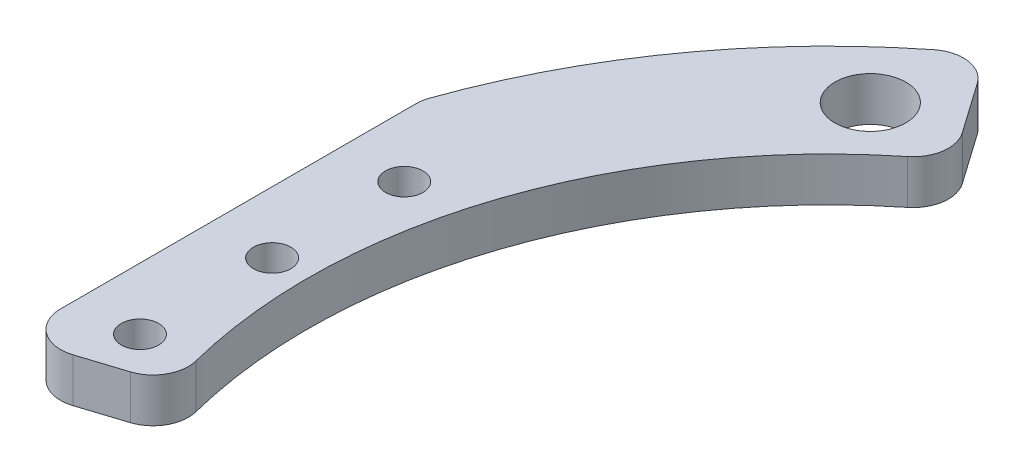
ISO-10303-21;
HEADER;
FILE_DESCRIPTION(('STEP AP214'),'2;1');
FILE_NAME('part.step','',(''),(''),'','','');
FILE_SCHEMA(('AUTOMOTIVE_DESIGN { 1 0 10303 214 1 1 1 1 }'));
ENDSEC;
DATA;
#1=APPLICATION_CONTEXT('core data for automotive mechanical design processes');
#2=APPLICATION_PROTOCOL_DEFINITION('international standard','automotive_design',2000,#1);
#3=PRODUCT_CONTEXT('',#1,'mechanical');
#4=PRODUCT('Part','Part','',(#3));
#5=PRODUCT_RELATED_PRODUCT_CATEGORY('part','',(#4));
#6=PRODUCT_DEFINITION_FORMATION('','',#4);
#7=PRODUCT_DEFINITION_CONTEXT('part definition',#1,'design');
#8=PRODUCT_DEFINITION('design','',#6,#7);
#9=PRODUCT_DEFINITION_SHAPE('','',#8);
#10=(LENGTH_UNIT() NAMED_UNIT(*) SI_UNIT(.MILLI.,.METRE.));
#11=(NAMED_UNIT(*) PLANE_ANGLE_UNIT() SI_UNIT($,.RADIAN.));
#12=(NAMED_UNIT(*) SI_UNIT($,.STERADIAN.) SOLID_ANGLE_UNIT());
#13=UNCERTAINTY_MEASURE_WITH_UNIT(LENGTH_MEASURE(1.E-05),#10,'distance_accuracy_value','');
#14=(GEOMETRIC_REPRESENTATION_CONTEXT(3) GLOBAL_UNCERTAINTY_ASSIGNED_CONTEXT((#13)) GLOBAL_UNIT_ASSIGNED_CONTEXT((#10,
#11,#12)) REPRESENTATION_CONTEXT('',''));
#15=CARTESIAN_POINT('',(0.,0.,0.));
#16=DIRECTION('',(0.,0.,1.));
#17=DIRECTION('',(1.,0.,0.));
#18=AXIS2_PLACEMENT_3D('',#15,#16,#17);
#19=CARTESIAN_POINT('',(0.,2.5,0.));
#20=DIRECTION('',(0.,1.,0.));
#21=DIRECTION('',(0.,0.,1.));
#22=AXIS2_PLACEMENT_3D('',#19,#20,#21);
#23=PLANE('',#22);
#24=CARTESIAN_POINT('',(0.,2.5,0.));
#25=DIRECTION('',(0.,1.,0.));
#26=DIRECTION('',(0.,0.,1.));
#27=AXIS2_PLACEMENT_3D('',#24,#25,#26);
#28=CIRCLE('',#27,74.);
#29=CARTESIAN_POINT('',(-45.9043498009371,2.5,-58.0412841807726));
#30=VERTEX_POINT('',#29);
#31=CARTESIAN_POINT('',(-69.7714285714286,2.5,-24.6565965839172));
#32=VERTEX_POINT('',#31);
#33=EDGE_CURVE('E127',#30,#32,#28,.T.);
#34=ORIENTED_EDGE('',*,*,#33,.T.);
#35=CARTESIAN_POINT('',(-66.,2.5,-23.3238075793811));
#36=DIRECTION('',(0.,1.,0.));
#37=DIRECTION('',(0.,0.,1.));
#38=AXIS2_PLACEMENT_3D('',#35,#36,#37);
#39=CIRCLE('',#38,4.);
#40=CARTESIAN_POINT('',(-70.,2.5,-23.3238075793811));
#41=VERTEX_POINT('',#40);
#42=EDGE_CURVE('E160',#32,#41,#39,.T.);
#43=ORIENTED_EDGE('',*,*,#42,.T.);
#44=DIRECTION('',(0.,0.,-1.));
#45=VECTOR('',#44,1.);
#46=CARTESIAN_POINT('',(-70.,2.5,0.));
#47=LINE('',#46,#45);
#48=CARTESIAN_POINT('',(-70.,2.5,17.0147788840506));
#49=VERTEX_POINT('',#48);
#50=EDGE_CURVE('E212',#49,#41,#47,.T.);
#51=ORIENTED_EDGE('',*,*,#50,.F.);
#52=CARTESIAN_POINT('',(-66.,2.5,17.0147788840506));
#53=DIRECTION('',(0.,1.,0.));
#54=DIRECTION('',(0.,0.,1.));
#55=AXIS2_PLACEMENT_3D('',#52,#53,#54);
#56=CIRCLE('',#55,4.);
#57=CARTESIAN_POINT('',(-64.7758541655303,2.5,20.82285805549));
#58=VERTEX_POINT('',#57);
#59=EDGE_CURVE('E158',#49,#58,#56,.T.);
#60=ORIENTED_EDGE('',*,*,#59,.T.);
#61=DIRECTION('',(0.952019792859847,0.,-0.306036458617425));
#62=VECTOR('',#61,1.);
#63=CARTESIAN_POINT('',(-70.4494646716287,2.5,22.6466979376894));
#64=LINE('',#63,#62);
#65=CARTESIAN_POINT('',(-59.8562334660791,2.5,19.2413958759294));
#66=VERTEX_POINT('',#65);
#67=EDGE_CURVE('E188',#58,#66,#64,.T.);
#68=ORIENTED_EDGE('',*,*,#67,.T.);
#69=CARTESIAN_POINT('',(-61.0803793005488,2.5,15.43331670449));
#70=DIRECTION('',(0.,1.,0.));
#71=DIRECTION('',(0.,0.,1.));
#72=AXIS2_PLACEMENT_3D('',#69,#70,#71);
#73=CIRCLE('',#72,4.);
#74=CARTESIAN_POINT('',(-57.202259979879,2.5,14.4534235803954));
#75=VERTEX_POINT('',#74);
#76=EDGE_CURVE('E156',#66,#75,#73,.T.);
#77=ORIENTED_EDGE('',*,*,#76,.T.);
#78=CARTESIAN_POINT('',(0.,2.5,0.));
#79=DIRECTION('',(0.,-1.,0.));
#80=DIRECTION('',(0.,0.,1.));
#81=AXIS2_PLACEMENT_3D('',#78,#79,#80);
#82=CIRCLE('',#81,59.);
#83=CARTESIAN_POINT('',(-36.8930249751412,2.5,-46.0424229182566));
#84=VERTEX_POINT('',#83);
#85=EDGE_CURVE('E187',#75,#84,#82,.T.);
#86=ORIENTED_EDGE('',*,*,#85,.T.);
#87=CARTESIAN_POINT('',(-39.3942470073542,2.5,-49.1639431161046));
#88=DIRECTION('',(0.,1.,0.));
#89=DIRECTION('',(0.,0.,1.));
#90=AXIS2_PLACEMENT_3D('',#87,#88,#89);
#91=CIRCLE('',#90,4.);
#92=CARTESIAN_POINT('',(-36.1202172170468,2.5,-51.4619267827523));
#93=VERTEX_POINT('',#92);
#94=EDGE_CURVE('E154',#84,#93,#91,.T.);
#95=ORIENTED_EDGE('',*,*,#94,.T.);
#96=DIRECTION('',(-0.574495916661929,0.,-0.81850744757685));
#97=VECTOR('',#96,1.);
#98=CARTESIAN_POINT('',(-42.5126978329828,2.5,-60.5695511206869));
#99=LINE('',#98,#97);
#100=CARTESIAN_POINT('',(-40.1490038051736,2.5,-57.2019011349461));
#101=VERTEX_POINT('',#100);
#102=EDGE_CURVE('E129',#93,#101,#99,.T.);
#103=ORIENTED_EDGE('',*,*,#102,.T.);
#104=CARTESIAN_POINT('',(-43.4230335954811,2.5,-54.9039174682984));
#105=DIRECTION('',(0.,1.,0.));
#106=DIRECTION('',(0.,0.,1.));
#107=AXIS2_PLACEMENT_3D('',#104,#105,#106);
#108=CIRCLE('',#107,4.);
#109=EDGE_CURVE('E152',#101,#30,#108,.T.);
#110=ORIENTED_EDGE('',*,*,#109,.T.);
#111=EDGE_LOOP('',(#34,#43,#51,#60,#68,#77,#86,#95,#103,#110));
#112=FACE_BOUND('',#111,.T.);
#113=CARTESIAN_POINT('',(-44.3299026712743,2.5,-49.2333446878774));
#114=DIRECTION('',(0.,1.,0.));
#115=DIRECTION('',(0.,0.,1.));
#116=AXIS2_PLACEMENT_3D('',#113,#114,#115);
#117=CIRCLE('',#116,4.025);
#118=CARTESIAN_POINT('',(-44.3299026712743,2.5,-45.2083446878774));
#119=VERTEX_POINT('',#118);
#120=EDGE_CURVE('E200',#119,#119,#117,.T.);
#121=ORIENTED_EDGE('',*,*,#120,.F.);
#122=EDGE_LOOP('',(#121));
#123=FACE_BOUND('',#122,.T.);
#124=CARTESIAN_POINT('',(-63.,2.5,0.));
#125=DIRECTION('',(0.,1.,0.));
#126=DIRECTION('',(0.,0.,1.));
#127=AXIS2_PLACEMENT_3D('',#124,#125,#126);
#128=CIRCLE('',#127,2.125);
#129=CARTESIAN_POINT('',(-63.,2.5,2.12500000000001));
#130=VERTEX_POINT('',#129);
#131=EDGE_CURVE('E137',#130,#130,#128,.T.);
#132=ORIENTED_EDGE('',*,*,#131,.F.);
#133=EDGE_LOOP('',(#132));
#134=FACE_BOUND('',#133,.T.);
#135=CARTESIAN_POINT('',(-63.,2.5,15.));
#136=DIRECTION('',(0.,1.,0.));
#137=DIRECTION('',(0.,0.,1.));
#138=AXIS2_PLACEMENT_3D('',#135,#136,#137);
#139=CIRCLE('',#138,2.125);
#140=CARTESIAN_POINT('',(-63.,2.5,17.125));
#141=VERTEX_POINT('',#140);
#142=EDGE_CURVE('E195',#141,#141,#139,.T.);
#143=ORIENTED_EDGE('',*,*,#142,.F.);
#144=EDGE_LOOP('',(#143));
#145=FACE_BOUND('',#144,.T.);
#146=CARTESIAN_POINT('',(-63.,2.5,-15.));
#147=DIRECTION('',(0.,1.,0.));
#148=DIRECTION('',(0.,0.,1.));
#149=AXIS2_PLACEMENT_3D('',#146,#147,#148);
#150=CIRCLE('',#149,2.125);
#151=CARTESIAN_POINT('',(-63.,2.5,-12.875));
#152=VERTEX_POINT('',#151);
#153=EDGE_CURVE('E206',#152,#152,#150,.T.);
#154=ORIENTED_EDGE('',*,*,#153,.F.);
#155=EDGE_LOOP('',(#154));
#156=FACE_BOUND('',#155,.T.);
#157=ADVANCED_FACE('F32',(#112,#123,#134,#145,#156),#23,.T.);
#158=CARTESIAN_POINT('',(0.,-2.5,0.));
#159=DIRECTION('',(0.,1.,0.));
#160=DIRECTION('',(0.,0.,1.));
#161=AXIS2_PLACEMENT_3D('',#158,#159,#160);
#162=PLANE('',#161);
#163=DIRECTION('',(0.,0.,-1.));
#164=VECTOR('',#163,1.);
#165=CARTESIAN_POINT('',(-70.,-2.5,-27.6660560000425));
#166=LINE('',#165,#164);
#167=CARTESIAN_POINT('',(-70.,-2.5,17.0147788840506));
#168=VERTEX_POINT('',#167);
#169=CARTESIAN_POINT('',(-70.,-2.5,-23.3238075793811));
#170=VERTEX_POINT('',#169);
#171=EDGE_CURVE('E217',#168,#170,#166,.T.);
#172=ORIENTED_EDGE('',*,*,#171,.T.);
#173=CARTESIAN_POINT('',(-66.,-2.5,-23.3238075793811));
#174=DIRECTION('',(0.,1.,0.));
#175=DIRECTION('',(0.,0.,1.));
#176=AXIS2_PLACEMENT_3D('',#173,#174,#175);
#177=CIRCLE('',#176,4.);
#178=CARTESIAN_POINT('',(-69.7714285714286,-2.5,-24.6565965839172));
#179=VERTEX_POINT('',#178);
#180=EDGE_CURVE('E135',#170,#179,#177,.F.);
#181=ORIENTED_EDGE('',*,*,#180,.T.);
#182=CARTESIAN_POINT('',(0.,-2.5,0.));
#183=DIRECTION('',(0.,1.,0.));
#184=DIRECTION('',(0.,0.,1.));
#185=AXIS2_PLACEMENT_3D('',#182,#183,#184);
#186=CIRCLE('',#185,74.);
#187=CARTESIAN_POINT('',(-45.9043498009371,-2.5,-58.0412841807726));
#188=VERTEX_POINT('',#187);
#189=EDGE_CURVE('E124',#188,#179,#186,.T.);
#190=ORIENTED_EDGE('',*,*,#189,.F.);
#191=CARTESIAN_POINT('',(-43.4230335954811,-2.5,-54.9039174682984));
#192=DIRECTION('',(0.,1.,0.));
#193=DIRECTION('',(0.,0.,1.));
#194=AXIS2_PLACEMENT_3D('',#191,#192,#193);
#195=CIRCLE('',#194,4.);
#196=CARTESIAN_POINT('',(-40.1490038051736,-2.5,-57.2019011349461));
#197=VERTEX_POINT('',#196);
#198=EDGE_CURVE('E111',#188,#197,#195,.F.);
#199=ORIENTED_EDGE('',*,*,#198,.T.);
#200=DIRECTION('',(-0.574495916661929,0.,-0.81850744757685));
#201=VECTOR('',#200,1.);
#202=CARTESIAN_POINT('',(-42.5126978329828,-2.5,-60.5695511206869));
#203=LINE('',#202,#201);
#204=CARTESIAN_POINT('',(-36.1202172170468,-2.5,-51.4619267827523));
#205=VERTEX_POINT('',#204);
#206=EDGE_CURVE('E149',#205,#197,#203,.T.);
#207=ORIENTED_EDGE('',*,*,#206,.F.);
#208=CARTESIAN_POINT('',(-39.3942470073542,-2.5,-49.1639431161046));
#209=DIRECTION('',(0.,1.,0.));
#210=DIRECTION('',(0.,0.,1.));
#211=AXIS2_PLACEMENT_3D('',#208,#209,#210);
#212=CIRCLE('',#211,4.);
#213=CARTESIAN_POINT('',(-36.8930249751412,-2.5,-46.0424229182566));
#214=VERTEX_POINT('',#213);
#215=EDGE_CURVE('E47',#205,#214,#212,.F.);
#216=ORIENTED_EDGE('',*,*,#215,.T.);
#217=CARTESIAN_POINT('',(0.,-2.5,0.));
#218=DIRECTION('',(0.,-1.,0.));
#219=DIRECTION('',(0.,0.,1.));
#220=AXIS2_PLACEMENT_3D('',#217,#218,#219);
#221=CIRCLE('',#220,59.);
#222=CARTESIAN_POINT('',(-57.202259979879,-2.5,14.4534235803954));
#223=VERTEX_POINT('',#222);
#224=EDGE_CURVE('E140',#223,#214,#221,.T.);
#225=ORIENTED_EDGE('',*,*,#224,.F.);
#226=CARTESIAN_POINT('',(-61.0803793005488,-2.5,15.43331670449));
#227=DIRECTION('',(0.,1.,0.));
#228=DIRECTION('',(0.,0.,1.));
#229=AXIS2_PLACEMENT_3D('',#226,#227,#228);
#230=CIRCLE('',#229,4.);
#231=CARTESIAN_POINT('',(-59.8562334660791,-2.5,19.2413958759294));
#232=VERTEX_POINT('',#231);
#233=EDGE_CURVE('E55',#223,#232,#230,.F.);
#234=ORIENTED_EDGE('',*,*,#233,.T.);
#235=DIRECTION('',(0.952019792859847,0.,-0.306036458617425));
#236=VECTOR('',#235,1.);
#237=CARTESIAN_POINT('',(-70.4494646716287,-2.5,22.6466979376894));
#238=LINE('',#237,#236);
#239=CARTESIAN_POINT('',(-64.7758541655303,-2.5,20.82285805549));
#240=VERTEX_POINT('',#239);
#241=EDGE_CURVE('E136',#240,#232,#238,.T.);
#242=ORIENTED_EDGE('',*,*,#241,.F.);
#243=CARTESIAN_POINT('',(-66.,-2.5,17.0147788840506));
#244=DIRECTION('',(0.,1.,0.));
#245=DIRECTION('',(0.,0.,1.));
#246=AXIS2_PLACEMENT_3D('',#243,#244,#245);
#247=CIRCLE('',#246,4.);
#248=EDGE_CURVE('E167',#240,#168,#247,.F.);
#249=ORIENTED_EDGE('',*,*,#248,.T.);
#250=EDGE_LOOP('',(#172,#181,#190,#199,#207,#216,#225,#234,#242,#249));
#251=FACE_BOUND('',#250,.T.);
#252=CARTESIAN_POINT('',(-63.,-2.5,0.));
#253=DIRECTION('',(0.,1.,0.));
#254=DIRECTION('',(0.,0.,1.));
#255=AXIS2_PLACEMENT_3D('',#252,#253,#254);
#256=CIRCLE('',#255,2.125);
#257=CARTESIAN_POINT('',(-63.,-2.5,2.12500000000001));
#258=VERTEX_POINT('',#257);
#259=EDGE_CURVE('E143',#258,#258,#256,.T.);
#260=ORIENTED_EDGE('',*,*,#259,.T.);
#261=EDGE_LOOP('',(#260));
#262=FACE_BOUND('',#261,.T.);
#263=CARTESIAN_POINT('',(-63.,-2.5,15.));
#264=DIRECTION('',(0.,1.,0.));
#265=DIRECTION('',(0.,0.,1.));
#266=AXIS2_PLACEMENT_3D('',#263,#264,#265);
#267=CIRCLE('',#266,2.125);
#268=CARTESIAN_POINT('',(-63.,-2.5,17.125));
#269=VERTEX_POINT('',#268);
#270=EDGE_CURVE('E197',#269,#269,#267,.T.);
#271=ORIENTED_EDGE('',*,*,#270,.T.);
#272=EDGE_LOOP('',(#271));
#273=FACE_BOUND('',#272,.T.);
#274=CARTESIAN_POINT('',(-44.3299026712743,-2.5,-49.2333446878774));
#275=DIRECTION('',(0.,1.,0.));
#276=DIRECTION('',(0.,0.,1.));
#277=AXIS2_PLACEMENT_3D('',#274,#275,#276);
#278=CIRCLE('',#277,4.025);
#279=CARTESIAN_POINT('',(-44.3299026712743,-2.5,-45.2083446878774));
#280=VERTEX_POINT('',#279);
#281=EDGE_CURVE('E203',#280,#280,#278,.T.);
#282=ORIENTED_EDGE('',*,*,#281,.T.);
#283=EDGE_LOOP('',(#282));
#284=FACE_BOUND('',#283,.T.);
#285=CARTESIAN_POINT('',(-63.,-2.5,-15.));
#286=DIRECTION('',(0.,1.,0.));
#287=DIRECTION('',(0.,0.,1.));
#288=AXIS2_PLACEMENT_3D('',#285,#286,#287);
#289=CIRCLE('',#288,2.125);
#290=CARTESIAN_POINT('',(-63.,-2.5,-12.875));
#291=VERTEX_POINT('',#290);
#292=EDGE_CURVE('E209',#291,#291,#289,.T.);
#293=ORIENTED_EDGE('',*,*,#292,.T.);
#294=EDGE_LOOP('',(#293));
#295=FACE_BOUND('',#294,.T.);
#296=ADVANCED_FACE('F132',(#251,#262,#273,#284,#295),#162,.F.);
#297=CARTESIAN_POINT('',(0.,2.5,0.));
#298=DIRECTION('',(0.,-1.,0.));
#299=DIRECTION('',(0.,0.,-1.));
#300=AXIS2_PLACEMENT_3D('',#297,#298,#299);
#301=CYLINDRICAL_SURFACE('',#300,74.);
#302=ORIENTED_EDGE('',*,*,#189,.T.);
#303=DIRECTION('',(0.,-1.,0.));
#304=VECTOR('',#303,1.);
#305=CARTESIAN_POINT('',(-69.7714285714286,2.5,-24.6565965839172));
#306=LINE('',#305,#304);
#307=EDGE_CURVE('E128',#179,#32,#306,.F.);
#308=ORIENTED_EDGE('',*,*,#307,.T.);
#309=ORIENTED_EDGE('',*,*,#33,.F.);
#310=DIRECTION('',(0.,-1.,0.));
#311=VECTOR('',#310,1.);
#312=CARTESIAN_POINT('',(-45.9043498009371,2.5,-58.0412841807726));
#313=LINE('',#312,#311);
#314=EDGE_CURVE('E114',#30,#188,#313,.T.);
#315=ORIENTED_EDGE('',*,*,#314,.T.);
#316=EDGE_LOOP('',(#302,#308,#309,#315));
#317=FACE_BOUND('',#316,.T.);
#318=ADVANCED_FACE('F122',(#317),#301,.T.);
#319=CARTESIAN_POINT('',(-70.4494646716287,2.5,22.6466979376894));
#320=DIRECTION('',(-0.306036458617425,0.,-0.952019792859847));
#321=DIRECTION('',(-0.952019792859847,0.,0.306036458617425));
#322=AXIS2_PLACEMENT_3D('',#319,#320,#321);
#323=PLANE('',#322);
#324=ORIENTED_EDGE('',*,*,#67,.F.);
#325=DIRECTION('',(0.,-1.,0.));
#326=VECTOR('',#325,1.);
#327=CARTESIAN_POINT('',(-64.7758541655303,2.5,20.82285805549));
#328=LINE('',#327,#326);
#329=EDGE_CURVE('E172',#58,#240,#328,.T.);
#330=ORIENTED_EDGE('',*,*,#329,.T.);
#331=ORIENTED_EDGE('',*,*,#241,.T.);
#332=DIRECTION('',(0.,-1.,0.));
#333=VECTOR('',#332,1.);
#334=CARTESIAN_POINT('',(-59.8562334660791,2.5,19.2413958759294));
#335=LINE('',#334,#333);
#336=EDGE_CURVE('E170',#232,#66,#335,.F.);
#337=ORIENTED_EDGE('',*,*,#336,.T.);
#338=EDGE_LOOP('',(#324,#330,#331,#337));
#339=FACE_BOUND('',#338,.T.);
#340=ADVANCED_FACE('F234',(#339),#323,.F.);
#341=CARTESIAN_POINT('',(0.,2.5,0.));
#342=DIRECTION('',(0.,-1.,0.));
#343=DIRECTION('',(0.,0.,-1.));
#344=AXIS2_PLACEMENT_3D('',#341,#342,#343);
#345=CYLINDRICAL_SURFACE('',#344,59.);
#346=ORIENTED_EDGE('',*,*,#85,.F.);
#347=DIRECTION('',(0.,-1.,0.));
#348=VECTOR('',#347,1.);
#349=CARTESIAN_POINT('',(-57.202259979879,2.5,14.4534235803954));
#350=LINE('',#349,#348);
#351=EDGE_CURVE('E177',#75,#223,#350,.T.);
#352=ORIENTED_EDGE('',*,*,#351,.T.);
#353=ORIENTED_EDGE('',*,*,#224,.T.);
#354=DIRECTION('',(0.,-1.,0.));
#355=VECTOR('',#354,1.);
#356=CARTESIAN_POINT('',(-36.8930249751412,2.5,-46.0424229182567));
#357=LINE('',#356,#355);
#358=EDGE_CURVE('E175',#214,#84,#357,.F.);
#359=ORIENTED_EDGE('',*,*,#358,.T.);
#360=EDGE_LOOP('',(#346,#352,#353,#359));
#361=FACE_BOUND('',#360,.T.);
#362=ADVANCED_FACE('F237',(#361),#345,.F.);
#363=CARTESIAN_POINT('',(-42.5126978329828,2.5,-60.5695511206869));
#364=DIRECTION('',(-0.81850744757685,0.,0.574495916661929));
#365=DIRECTION('',(0.574495916661929,0.,0.81850744757685));
#366=AXIS2_PLACEMENT_3D('',#363,#364,#365);
#367=PLANE('',#366);
#368=ORIENTED_EDGE('',*,*,#102,.F.);
#369=DIRECTION('',(0.,-1.,0.));
#370=VECTOR('',#369,1.);
#371=CARTESIAN_POINT('',(-36.1202172170468,2.5,-51.4619267827523));
#372=LINE('',#371,#370);
#373=EDGE_CURVE('E11',#93,#205,#372,.T.);
#374=ORIENTED_EDGE('',*,*,#373,.T.);
#375=ORIENTED_EDGE('',*,*,#206,.T.);
#376=DIRECTION('',(0.,-1.,0.));
#377=VECTOR('',#376,1.);
#378=CARTESIAN_POINT('',(-40.1490038051736,2.5,-57.2019011349461));
#379=LINE('',#378,#377);
#380=EDGE_CURVE('E40',#197,#101,#379,.F.);
#381=ORIENTED_EDGE('',*,*,#380,.T.);
#382=EDGE_LOOP('',(#368,#374,#375,#381));
#383=FACE_BOUND('',#382,.T.);
#384=ADVANCED_FACE('F181',(#383),#367,.F.);
#385=CARTESIAN_POINT('',(-63.,2.5,0.));
#386=DIRECTION('',(0.,-1.,0.));
#387=DIRECTION('',(0.,0.,-1.));
#388=AXIS2_PLACEMENT_3D('',#385,#386,#387);
#389=CYLINDRICAL_SURFACE('',#388,2.125);
#390=ORIENTED_EDGE('',*,*,#131,.T.);
#391=EDGE_LOOP('',(#390));
#392=FACE_BOUND('',#391,.T.);
#393=ORIENTED_EDGE('',*,*,#259,.F.);
#394=EDGE_LOOP('',(#393));
#395=FACE_BOUND('',#394,.T.);
#396=ADVANCED_FACE('F254',(#392,#395),#389,.F.);
#397=CARTESIAN_POINT('',(-63.,2.5,15.));
#398=DIRECTION('',(0.,-1.,0.));
#399=DIRECTION('',(0.,0.,-1.));
#400=AXIS2_PLACEMENT_3D('',#397,#398,#399);
#401=CYLINDRICAL_SURFACE('',#400,2.125);
#402=ORIENTED_EDGE('',*,*,#142,.T.);
#403=EDGE_LOOP('',(#402));
#404=FACE_BOUND('',#403,.T.);
#405=ORIENTED_EDGE('',*,*,#270,.F.);
#406=EDGE_LOOP('',(#405));
#407=FACE_BOUND('',#406,.T.);
#408=ADVANCED_FACE('F320',(#404,#407),#401,.F.);
#409=CARTESIAN_POINT('',(-44.3299026712743,2.5,-49.2333446878774));
#410=DIRECTION('',(0.,-1.,0.));
#411=DIRECTION('',(0.,0.,-1.));
#412=AXIS2_PLACEMENT_3D('',#409,#410,#411);
#413=CYLINDRICAL_SURFACE('',#412,4.025);
#414=ORIENTED_EDGE('',*,*,#120,.T.);
#415=EDGE_LOOP('',(#414));
#416=FACE_BOUND('',#415,.T.);
#417=ORIENTED_EDGE('',*,*,#281,.F.);
#418=EDGE_LOOP('',(#417));
#419=FACE_BOUND('',#418,.T.);
#420=ADVANCED_FACE('F311',(#416,#419),#413,.F.);
#421=CARTESIAN_POINT('',(-63.,2.5,-15.));
#422=DIRECTION('',(0.,-1.,0.));
#423=DIRECTION('',(0.,0.,-1.));
#424=AXIS2_PLACEMENT_3D('',#421,#422,#423);
#425=CYLINDRICAL_SURFACE('',#424,2.125);
#426=ORIENTED_EDGE('',*,*,#153,.T.);
#427=EDGE_LOOP('',(#426));
#428=FACE_BOUND('',#427,.T.);
#429=ORIENTED_EDGE('',*,*,#292,.F.);
#430=EDGE_LOOP('',(#429));
#431=FACE_BOUND('',#430,.T.);
#432=ADVANCED_FACE('F302',(#428,#431),#425,.F.);
#433=CARTESIAN_POINT('',(-70.,-2.5,-27.6660560000425));
#434=DIRECTION('',(1.,0.,0.));
#435=DIRECTION('',(0.,0.,-1.));
#436=AXIS2_PLACEMENT_3D('',#433,#434,#435);
#437=PLANE('',#436);
#438=ORIENTED_EDGE('',*,*,#50,.T.);
#439=DIRECTION('',(0.,-1.,0.));
#440=VECTOR('',#439,1.);
#441=CARTESIAN_POINT('',(-70.,-2.5,-23.3238075793811));
#442=LINE('',#441,#440);
#443=EDGE_CURVE('E117',#41,#170,#442,.T.);
#444=ORIENTED_EDGE('',*,*,#443,.T.);
#445=ORIENTED_EDGE('',*,*,#171,.F.);
#446=DIRECTION('',(0.,-1.,0.));
#447=VECTOR('',#446,1.);
#448=CARTESIAN_POINT('',(-70.,-2.5,17.0147788840506));
#449=LINE('',#448,#447);
#450=EDGE_CURVE('E162',#168,#49,#449,.F.);
#451=ORIENTED_EDGE('',*,*,#450,.T.);
#452=EDGE_LOOP('',(#438,#444,#445,#451));
#453=FACE_BOUND('',#452,.T.);
#454=ADVANCED_FACE('F227',(#453),#437,.F.);
#455=CARTESIAN_POINT('',(-66.,2.5,-23.3238075793811));
#456=DIRECTION('',(0.,-1.,0.));
#457=DIRECTION('',(0.,0.,-1.));
#458=AXIS2_PLACEMENT_3D('',#455,#456,#457);
#459=CYLINDRICAL_SURFACE('',#458,4.);
#460=ORIENTED_EDGE('',*,*,#180,.F.);
#461=ORIENTED_EDGE('',*,*,#443,.F.);
#462=ORIENTED_EDGE('',*,*,#42,.F.);
#463=ORIENTED_EDGE('',*,*,#307,.F.);
#464=EDGE_LOOP('',(#460,#461,#462,#463));
#465=FACE_BOUND('',#464,.T.);
#466=ADVANCED_FACE('F224',(#465),#459,.T.);
#467=CARTESIAN_POINT('',(-66.,2.5,17.0147788840506));
#468=DIRECTION('',(0.,-1.,0.));
#469=DIRECTION('',(0.,0.,-1.));
#470=AXIS2_PLACEMENT_3D('',#467,#468,#469);
#471=CYLINDRICAL_SURFACE('',#470,4.);
#472=ORIENTED_EDGE('',*,*,#59,.F.);
#473=ORIENTED_EDGE('',*,*,#450,.F.);
#474=ORIENTED_EDGE('',*,*,#248,.F.);
#475=ORIENTED_EDGE('',*,*,#329,.F.);
#476=EDGE_LOOP('',(#472,#473,#474,#475));
#477=FACE_BOUND('',#476,.T.);
#478=ADVANCED_FACE('F229',(#477),#471,.T.);
#479=CARTESIAN_POINT('',(-61.0803793005488,2.5,15.43331670449));
#480=DIRECTION('',(0.,-1.,0.));
#481=DIRECTION('',(0.,0.,-1.));
#482=AXIS2_PLACEMENT_3D('',#479,#480,#481);
#483=CYLINDRICAL_SURFACE('',#482,4.);
#484=ORIENTED_EDGE('',*,*,#76,.F.);
#485=ORIENTED_EDGE('',*,*,#336,.F.);
#486=ORIENTED_EDGE('',*,*,#233,.F.);
#487=ORIENTED_EDGE('',*,*,#351,.F.);
#488=EDGE_LOOP('',(#484,#485,#486,#487));
#489=FACE_BOUND('',#488,.T.);
#490=ADVANCED_FACE('F235',(#489),#483,.T.);
#491=CARTESIAN_POINT('',(-39.3942470073542,2.5,-49.1639431161046));
#492=DIRECTION('',(0.,-1.,0.));
#493=DIRECTION('',(0.,0.,-1.));
#494=AXIS2_PLACEMENT_3D('',#491,#492,#493);
#495=CYLINDRICAL_SURFACE('',#494,4.);
#496=ORIENTED_EDGE('',*,*,#94,.F.);
#497=ORIENTED_EDGE('',*,*,#358,.F.);
#498=ORIENTED_EDGE('',*,*,#215,.F.);
#499=ORIENTED_EDGE('',*,*,#373,.F.);
#500=EDGE_LOOP('',(#496,#497,#498,#499));
#501=FACE_BOUND('',#500,.T.);
#502=ADVANCED_FACE('F240',(#501),#495,.T.);
#503=CARTESIAN_POINT('',(-43.4230335954811,2.5,-54.9039174682984));
#504=DIRECTION('',(0.,-1.,0.));
#505=DIRECTION('',(0.,0.,-1.));
#506=AXIS2_PLACEMENT_3D('',#503,#504,#505);
#507=CYLINDRICAL_SURFACE('',#506,4.);
#508=ORIENTED_EDGE('',*,*,#109,.F.);
#509=ORIENTED_EDGE('',*,*,#380,.F.);
#510=ORIENTED_EDGE('',*,*,#198,.F.);
#511=ORIENTED_EDGE('',*,*,#314,.F.);
#512=EDGE_LOOP('',(#508,#509,#510,#511));
#513=FACE_BOUND('',#512,.T.);
#514=ADVANCED_FACE('F34',(#513),#507,.T.);
#515=CLOSED_SHELL('',(#157,#296,#318,#340,#362,#384,#396,#408,#420,#432,#454,#466,#478,#490,
#502,#514));
#516=MANIFOLD_SOLID_BREP('B2',#515);
#517=ADVANCED_BREP_SHAPE_REPRESENTATION('',(#18,#516),#14);
#518=SHAPE_DEFINITION_REPRESENTATION(#9,#517);
ENDSEC;
END-ISO-10303-21;
